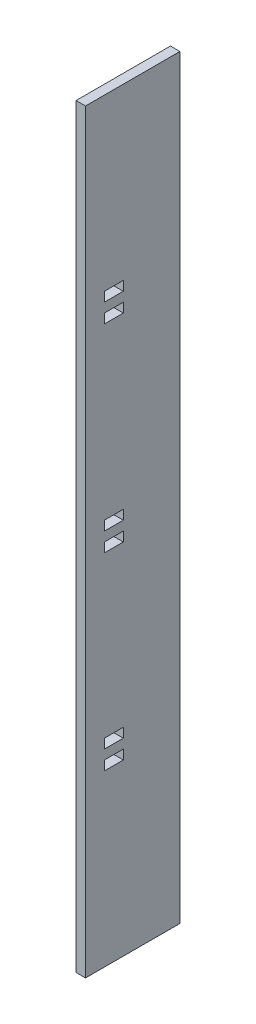
ISO-10303-21;
HEADER;
FILE_DESCRIPTION(('STEP AP214'),'2;1');
FILE_NAME('part.step','',(''),(''),'','','');
FILE_SCHEMA(('AUTOMOTIVE_DESIGN { 1 0 10303 214 1 1 1 1 }'));
ENDSEC;
DATA;
#1=APPLICATION_CONTEXT('core data for automotive mechanical design processes');
#2=APPLICATION_PROTOCOL_DEFINITION('international standard','automotive_design',2000,#1);
#3=PRODUCT_CONTEXT('',#1,'mechanical');
#4=PRODUCT('Part','Part','',(#3));
#5=PRODUCT_RELATED_PRODUCT_CATEGORY('part','',(#4));
#6=PRODUCT_DEFINITION_FORMATION('','',#4);
#7=PRODUCT_DEFINITION_CONTEXT('part definition',#1,'design');
#8=PRODUCT_DEFINITION('design','',#6,#7);
#9=PRODUCT_DEFINITION_SHAPE('','',#8);
#10=(LENGTH_UNIT() NAMED_UNIT(*) SI_UNIT(.MILLI.,.METRE.));
#11=(NAMED_UNIT(*) PLANE_ANGLE_UNIT() SI_UNIT($,.RADIAN.));
#12=(NAMED_UNIT(*) SI_UNIT($,.STERADIAN.) SOLID_ANGLE_UNIT());
#13=UNCERTAINTY_MEASURE_WITH_UNIT(LENGTH_MEASURE(1.E-05),#10,'distance_accuracy_value','');
#14=(GEOMETRIC_REPRESENTATION_CONTEXT(3) GLOBAL_UNCERTAINTY_ASSIGNED_CONTEXT((#13)) GLOBAL_UNIT_ASSIGNED_CONTEXT((#10,
#11,#12)) REPRESENTATION_CONTEXT('',''));
#15=CARTESIAN_POINT('',(0.,0.,0.));
#16=DIRECTION('',(0.,0.,1.));
#17=DIRECTION('',(1.,0.,0.));
#18=AXIS2_PLACEMENT_3D('',#15,#16,#17);
#19=CARTESIAN_POINT('',(6.35,0.,-12.7));
#20=DIRECTION('',(0.,0.,-1.));
#21=DIRECTION('',(-1.,0.,0.));
#22=AXIS2_PLACEMENT_3D('',#19,#20,#21);
#23=PLANE('',#22);
#24=DIRECTION('',(0.,-1.,0.));
#25=VECTOR('',#24,1.);
#26=CARTESIAN_POINT('',(0.,0.,-12.7));
#27=LINE('',#26,#25);
#28=CARTESIAN_POINT('',(0.,381.,-12.7));
#29=VERTEX_POINT('',#28);
#30=CARTESIAN_POINT('',(0.,374.65,-12.7));
#31=VERTEX_POINT('',#30);
#32=EDGE_CURVE('E384',#29,#31,#27,.T.);
#33=ORIENTED_EDGE('',*,*,#32,.F.);
#34=DIRECTION('',(-1.,0.,0.));
#35=VECTOR('',#34,1.);
#36=CARTESIAN_POINT('',(6.35,381.,-12.7));
#37=LINE('',#36,#35);
#38=CARTESIAN_POINT('',(6.35,381.,-12.7));
#39=VERTEX_POINT('',#38);
#40=EDGE_CURVE('E11',#39,#29,#37,.T.);
#41=ORIENTED_EDGE('',*,*,#40,.F.);
#42=DIRECTION('',(0.,-1.,0.));
#43=VECTOR('',#42,1.);
#44=CARTESIAN_POINT('',(6.35,0.,-12.7));
#45=LINE('',#44,#43);
#46=CARTESIAN_POINT('',(6.35,374.65,-12.7));
#47=VERTEX_POINT('',#46);
#48=EDGE_CURVE('E238',#39,#47,#45,.T.);
#49=ORIENTED_EDGE('',*,*,#48,.T.);
#50=DIRECTION('',(-1.,0.,0.));
#51=VECTOR('',#50,1.);
#52=CARTESIAN_POINT('',(6.35,374.65,-12.7));
#53=LINE('',#52,#51);
#54=EDGE_CURVE('E52',#47,#31,#53,.T.);
#55=ORIENTED_EDGE('',*,*,#54,.T.);
#56=EDGE_LOOP('',(#33,#41,#49,#55));
#57=FACE_BOUND('',#56,.T.);
#58=ADVANCED_FACE('F33',(#57),#23,.T.);
#59=CARTESIAN_POINT('',(6.35,381.,0.));
#60=DIRECTION('',(0.,1.,0.));
#61=DIRECTION('',(0.,0.,1.));
#62=AXIS2_PLACEMENT_3D('',#59,#60,#61);
#63=PLANE('',#62);
#64=DIRECTION('',(0.,0.,-1.));
#65=VECTOR('',#64,1.);
#66=CARTESIAN_POINT('',(0.,381.,0.));
#67=LINE('',#66,#65);
#68=CARTESIAN_POINT('',(0.,381.,-25.4));
#69=VERTEX_POINT('',#68);
#70=EDGE_CURVE('E243',#29,#69,#67,.T.);
#71=ORIENTED_EDGE('',*,*,#70,.T.);
#72=DIRECTION('',(-1.,0.,0.));
#73=VECTOR('',#72,1.);
#74=CARTESIAN_POINT('',(6.35,381.,-25.4));
#75=LINE('',#74,#73);
#76=CARTESIAN_POINT('',(6.35,381.,-25.4));
#77=VERTEX_POINT('',#76);
#78=EDGE_CURVE('E43',#77,#69,#75,.T.);
#79=ORIENTED_EDGE('',*,*,#78,.F.);
#80=DIRECTION('',(0.,0.,-1.));
#81=VECTOR('',#80,1.);
#82=CARTESIAN_POINT('',(6.35,381.,0.));
#83=LINE('',#82,#81);
#84=EDGE_CURVE('E233',#39,#77,#83,.T.);
#85=ORIENTED_EDGE('',*,*,#84,.F.);
#86=ORIENTED_EDGE('',*,*,#40,.T.);
#87=EDGE_LOOP('',(#71,#79,#85,#86));
#88=FACE_BOUND('',#87,.T.);
#89=ADVANCED_FACE('F241',(#88),#63,.F.);
#90=CARTESIAN_POINT('',(6.35,0.,-25.4));
#91=DIRECTION('',(0.,0.,-1.));
#92=DIRECTION('',(-1.,0.,0.));
#93=AXIS2_PLACEMENT_3D('',#90,#91,#92);
#94=PLANE('',#93);
#95=DIRECTION('',(0.,-1.,0.));
#96=VECTOR('',#95,1.);
#97=CARTESIAN_POINT('',(0.,0.,-25.4));
#98=LINE('',#97,#96);
#99=CARTESIAN_POINT('',(0.,374.65,-25.4));
#100=VERTEX_POINT('',#99);
#101=EDGE_CURVE('E387',#69,#100,#98,.T.);
#102=ORIENTED_EDGE('',*,*,#101,.T.);
#103=DIRECTION('',(-1.,0.,0.));
#104=VECTOR('',#103,1.);
#105=CARTESIAN_POINT('',(6.35,374.65,-25.4));
#106=LINE('',#105,#104);
#107=CARTESIAN_POINT('',(6.35,374.65,-25.4));
#108=VERTEX_POINT('',#107);
#109=EDGE_CURVE('E138',#108,#100,#106,.T.);
#110=ORIENTED_EDGE('',*,*,#109,.F.);
#111=DIRECTION('',(0.,-1.,0.));
#112=VECTOR('',#111,1.);
#113=CARTESIAN_POINT('',(6.35,0.,-25.4));
#114=LINE('',#113,#112);
#115=EDGE_CURVE('E225',#77,#108,#114,.T.);
#116=ORIENTED_EDGE('',*,*,#115,.F.);
#117=ORIENTED_EDGE('',*,*,#78,.T.);
#118=EDGE_LOOP('',(#102,#110,#116,#117));
#119=FACE_BOUND('',#118,.T.);
#120=ADVANCED_FACE('F227',(#119),#94,.F.);
#121=CARTESIAN_POINT('',(6.35,247.65,0.));
#122=DIRECTION('',(0.,1.,0.));
#123=DIRECTION('',(0.,0.,1.));
#124=AXIS2_PLACEMENT_3D('',#121,#122,#123);
#125=PLANE('',#124);
#126=DIRECTION('',(0.,0.,-1.));
#127=VECTOR('',#126,1.);
#128=CARTESIAN_POINT('',(0.,247.65,0.));
#129=LINE('',#128,#127);
#130=CARTESIAN_POINT('',(0.,247.65,-12.7));
#131=VERTEX_POINT('',#130);
#132=CARTESIAN_POINT('',(0.,247.65,-25.4));
#133=VERTEX_POINT('',#132);
#134=EDGE_CURVE('E372',#131,#133,#129,.T.);
#135=ORIENTED_EDGE('',*,*,#134,.T.);
#136=DIRECTION('',(-1.,0.,0.));
#137=VECTOR('',#136,1.);
#138=CARTESIAN_POINT('',(6.35,247.65,-25.4));
#139=LINE('',#138,#137);
#140=CARTESIAN_POINT('',(6.35,247.65,-25.4));
#141=VERTEX_POINT('',#140);
#142=EDGE_CURVE('E255',#141,#133,#139,.T.);
#143=ORIENTED_EDGE('',*,*,#142,.F.);
#144=DIRECTION('',(0.,0.,-1.));
#145=VECTOR('',#144,1.);
#146=CARTESIAN_POINT('',(6.35,247.65,0.));
#147=LINE('',#146,#145);
#148=CARTESIAN_POINT('',(6.35,247.65,-12.7));
#149=VERTEX_POINT('',#148);
#150=EDGE_CURVE('E446',#149,#141,#147,.T.);
#151=ORIENTED_EDGE('',*,*,#150,.F.);
#152=DIRECTION('',(-1.,0.,0.));
#153=VECTOR('',#152,1.);
#154=CARTESIAN_POINT('',(6.35,247.65,-12.7));
#155=LINE('',#154,#153);
#156=EDGE_CURVE('E248',#149,#131,#155,.T.);
#157=ORIENTED_EDGE('',*,*,#156,.T.);
#158=EDGE_LOOP('',(#135,#143,#151,#157));
#159=FACE_BOUND('',#158,.T.);
#160=ADVANCED_FACE('F493',(#159),#125,.F.);
#161=CARTESIAN_POINT('',(6.35,0.,-25.4000000000001));
#162=DIRECTION('',(0.,0.,-1.));
#163=DIRECTION('',(0.,1.,0.));
#164=AXIS2_PLACEMENT_3D('',#161,#162,#163);
#165=PLANE('',#164);
#166=DIRECTION('',(0.,-1.,0.));
#167=VECTOR('',#166,1.);
#168=CARTESIAN_POINT('',(0.,0.,-25.4000000000001));
#169=LINE('',#168,#167);
#170=CARTESIAN_POINT('',(0.,241.3,-25.4));
#171=VERTEX_POINT('',#170);
#172=EDGE_CURVE('E375',#133,#171,#169,.T.);
#173=ORIENTED_EDGE('',*,*,#172,.T.);
#174=DIRECTION('',(-1.,0.,0.));
#175=VECTOR('',#174,1.);
#176=CARTESIAN_POINT('',(6.35,241.3,-25.4));
#177=LINE('',#176,#175);
#178=CARTESIAN_POINT('',(6.35,241.3,-25.4));
#179=VERTEX_POINT('',#178);
#180=EDGE_CURVE('E253',#179,#171,#177,.T.);
#181=ORIENTED_EDGE('',*,*,#180,.F.);
#182=DIRECTION('',(0.,-1.,0.));
#183=VECTOR('',#182,1.);
#184=CARTESIAN_POINT('',(6.35,0.,-25.4000000000001));
#185=LINE('',#184,#183);
#186=EDGE_CURVE('E449',#141,#179,#185,.T.);
#187=ORIENTED_EDGE('',*,*,#186,.F.);
#188=ORIENTED_EDGE('',*,*,#142,.T.);
#189=EDGE_LOOP('',(#173,#181,#187,#188));
#190=FACE_BOUND('',#189,.T.);
#191=ADVANCED_FACE('F489',(#190),#165,.F.);
#192=CARTESIAN_POINT('',(6.35,241.3,0.));
#193=DIRECTION('',(0.,1.,0.));
#194=DIRECTION('',(0.,0.,1.));
#195=AXIS2_PLACEMENT_3D('',#192,#193,#194);
#196=PLANE('',#195);
#197=DIRECTION('',(0.,0.,-1.));
#198=VECTOR('',#197,1.);
#199=CARTESIAN_POINT('',(0.,241.3,0.));
#200=LINE('',#199,#198);
#201=CARTESIAN_POINT('',(0.,241.3,-12.7));
#202=VERTEX_POINT('',#201);
#203=EDGE_CURVE('E378',#202,#171,#200,.T.);
#204=ORIENTED_EDGE('',*,*,#203,.F.);
#205=DIRECTION('',(-1.,0.,0.));
#206=VECTOR('',#205,1.);
#207=CARTESIAN_POINT('',(6.35,241.3,-12.7));
#208=LINE('',#207,#206);
#209=CARTESIAN_POINT('',(6.35,241.3,-12.7));
#210=VERTEX_POINT('',#209);
#211=EDGE_CURVE('E250',#210,#202,#208,.T.);
#212=ORIENTED_EDGE('',*,*,#211,.F.);
#213=DIRECTION('',(0.,0.,-1.));
#214=VECTOR('',#213,1.);
#215=CARTESIAN_POINT('',(6.35,241.3,0.));
#216=LINE('',#215,#214);
#217=EDGE_CURVE('E451',#210,#179,#216,.T.);
#218=ORIENTED_EDGE('',*,*,#217,.T.);
#219=ORIENTED_EDGE('',*,*,#180,.T.);
#220=EDGE_LOOP('',(#204,#212,#218,#219));
#221=FACE_BOUND('',#220,.T.);
#222=ADVANCED_FACE('F485',(#221),#196,.T.);
#223=CARTESIAN_POINT('',(6.35,120.65,0.));
#224=DIRECTION('',(0.,1.,0.));
#225=DIRECTION('',(0.,0.,1.));
#226=AXIS2_PLACEMENT_3D('',#223,#224,#225);
#227=PLANE('',#226);
#228=DIRECTION('',(0.,0.,-1.));
#229=VECTOR('',#228,1.);
#230=CARTESIAN_POINT('',(0.,120.65,0.));
#231=LINE('',#230,#229);
#232=CARTESIAN_POINT('',(0.,120.65,-12.7));
#233=VERTEX_POINT('',#232);
#234=CARTESIAN_POINT('',(0.,120.65,-25.4));
#235=VERTEX_POINT('',#234);
#236=EDGE_CURVE('E360',#233,#235,#231,.T.);
#237=ORIENTED_EDGE('',*,*,#236,.T.);
#238=DIRECTION('',(-1.,0.,0.));
#239=VECTOR('',#238,1.);
#240=CARTESIAN_POINT('',(6.35,120.65,-25.4));
#241=LINE('',#240,#239);
#242=CARTESIAN_POINT('',(6.35,120.65,-25.4));
#243=VERTEX_POINT('',#242);
#244=EDGE_CURVE('E251',#243,#235,#241,.T.);
#245=ORIENTED_EDGE('',*,*,#244,.F.);
#246=DIRECTION('',(0.,0.,-1.));
#247=VECTOR('',#246,1.);
#248=CARTESIAN_POINT('',(6.35,120.65,0.));
#249=LINE('',#248,#247);
#250=CARTESIAN_POINT('',(6.35,120.65,-12.7));
#251=VERTEX_POINT('',#250);
#252=EDGE_CURVE('E435',#251,#243,#249,.T.);
#253=ORIENTED_EDGE('',*,*,#252,.F.);
#254=DIRECTION('',(-1.,0.,0.));
#255=VECTOR('',#254,1.);
#256=CARTESIAN_POINT('',(6.35,120.65,-12.7));
#257=LINE('',#256,#255);
#258=EDGE_CURVE('E258',#251,#233,#257,.T.);
#259=ORIENTED_EDGE('',*,*,#258,.T.);
#260=EDGE_LOOP('',(#237,#245,#253,#259));
#261=FACE_BOUND('',#260,.T.);
#262=ADVANCED_FACE('F488',(#261),#227,.F.);
#263=CARTESIAN_POINT('',(6.35,0.,-25.4));
#264=DIRECTION('',(0.,0.,-1.));
#265=DIRECTION('',(-1.,0.,0.));
#266=AXIS2_PLACEMENT_3D('',#263,#264,#265);
#267=PLANE('',#266);
#268=DIRECTION('',(0.,-1.,0.));
#269=VECTOR('',#268,1.);
#270=CARTESIAN_POINT('',(0.,0.,-25.4));
#271=LINE('',#270,#269);
#272=CARTESIAN_POINT('',(0.,114.3,-25.4));
#273=VERTEX_POINT('',#272);
#274=EDGE_CURVE('E363',#235,#273,#271,.T.);
#275=ORIENTED_EDGE('',*,*,#274,.T.);
#276=DIRECTION('',(-1.,0.,0.));
#277=VECTOR('',#276,1.);
#278=CARTESIAN_POINT('',(6.35,114.3,-25.4));
#279=LINE('',#278,#277);
#280=CARTESIAN_POINT('',(6.35,114.3,-25.4));
#281=VERTEX_POINT('',#280);
#282=EDGE_CURVE('E263',#281,#273,#279,.T.);
#283=ORIENTED_EDGE('',*,*,#282,.F.);
#284=DIRECTION('',(0.,-1.,0.));
#285=VECTOR('',#284,1.);
#286=CARTESIAN_POINT('',(6.35,0.,-25.4));
#287=LINE('',#286,#285);
#288=EDGE_CURVE('E438',#243,#281,#287,.T.);
#289=ORIENTED_EDGE('',*,*,#288,.F.);
#290=ORIENTED_EDGE('',*,*,#244,.T.);
#291=EDGE_LOOP('',(#275,#283,#289,#290));
#292=FACE_BOUND('',#291,.T.);
#293=ADVANCED_FACE('F506',(#292),#267,.F.);
#294=CARTESIAN_POINT('',(6.35,114.3,0.));
#295=DIRECTION('',(0.,1.,0.));
#296=DIRECTION('',(0.,0.,1.));
#297=AXIS2_PLACEMENT_3D('',#294,#295,#296);
#298=PLANE('',#297);
#299=DIRECTION('',(0.,0.,-1.));
#300=VECTOR('',#299,1.);
#301=CARTESIAN_POINT('',(0.,114.3,0.));
#302=LINE('',#301,#300);
#303=CARTESIAN_POINT('',(0.,114.3,-12.7));
#304=VERTEX_POINT('',#303);
#305=EDGE_CURVE('E366',#304,#273,#302,.T.);
#306=ORIENTED_EDGE('',*,*,#305,.F.);
#307=DIRECTION('',(-1.,0.,0.));
#308=VECTOR('',#307,1.);
#309=CARTESIAN_POINT('',(6.35,114.3,-12.7));
#310=LINE('',#309,#308);
#311=CARTESIAN_POINT('',(6.35,114.3,-12.7));
#312=VERTEX_POINT('',#311);
#313=EDGE_CURVE('E260',#312,#304,#310,.T.);
#314=ORIENTED_EDGE('',*,*,#313,.F.);
#315=DIRECTION('',(0.,0.,-1.));
#316=VECTOR('',#315,1.);
#317=CARTESIAN_POINT('',(6.35,114.3,0.));
#318=LINE('',#317,#316);
#319=EDGE_CURVE('E440',#312,#281,#318,.T.);
#320=ORIENTED_EDGE('',*,*,#319,.T.);
#321=ORIENTED_EDGE('',*,*,#282,.T.);
#322=EDGE_LOOP('',(#306,#314,#320,#321));
#323=FACE_BOUND('',#322,.T.);
#324=ADVANCED_FACE('F502',(#323),#298,.T.);
#325=CARTESIAN_POINT('',(6.35,260.35,0.));
#326=DIRECTION('',(0.,1.,0.));
#327=DIRECTION('',(0.,0.,1.));
#328=AXIS2_PLACEMENT_3D('',#325,#326,#327);
#329=PLANE('',#328);
#330=DIRECTION('',(0.,0.,-1.));
#331=VECTOR('',#330,1.);
#332=CARTESIAN_POINT('',(0.,260.35,0.));
#333=LINE('',#332,#331);
#334=CARTESIAN_POINT('',(0.,260.35,-12.7));
#335=VERTEX_POINT('',#334);
#336=CARTESIAN_POINT('',(0.,260.35,-25.4));
#337=VERTEX_POINT('',#336);
#338=EDGE_CURVE('E348',#335,#337,#333,.T.);
#339=ORIENTED_EDGE('',*,*,#338,.T.);
#340=DIRECTION('',(-1.,0.,0.));
#341=VECTOR('',#340,1.);
#342=CARTESIAN_POINT('',(6.35,260.35,-25.4));
#343=LINE('',#342,#341);
#344=CARTESIAN_POINT('',(6.35,260.35,-25.4));
#345=VERTEX_POINT('',#344);
#346=EDGE_CURVE('E261',#345,#337,#343,.T.);
#347=ORIENTED_EDGE('',*,*,#346,.F.);
#348=DIRECTION('',(0.,0.,-1.));
#349=VECTOR('',#348,1.);
#350=CARTESIAN_POINT('',(6.35,260.35,0.));
#351=LINE('',#350,#349);
#352=CARTESIAN_POINT('',(6.35,260.35,-12.7));
#353=VERTEX_POINT('',#352);
#354=EDGE_CURVE('E424',#353,#345,#351,.T.);
#355=ORIENTED_EDGE('',*,*,#354,.F.);
#356=DIRECTION('',(-1.,0.,0.));
#357=VECTOR('',#356,1.);
#358=CARTESIAN_POINT('',(6.35,260.35,-12.7));
#359=LINE('',#358,#357);
#360=EDGE_CURVE('E267',#353,#335,#359,.T.);
#361=ORIENTED_EDGE('',*,*,#360,.T.);
#362=EDGE_LOOP('',(#339,#347,#355,#361));
#363=FACE_BOUND('',#362,.T.);
#364=ADVANCED_FACE('F505',(#363),#329,.F.);
#365=CARTESIAN_POINT('',(6.35,0.,-25.4));
#366=DIRECTION('',(0.,0.,-1.));
#367=DIRECTION('',(-1.,0.,0.));
#368=AXIS2_PLACEMENT_3D('',#365,#366,#367);
#369=PLANE('',#368);
#370=DIRECTION('',(0.,-1.,0.));
#371=VECTOR('',#370,1.);
#372=CARTESIAN_POINT('',(0.,0.,-25.4));
#373=LINE('',#372,#371);
#374=CARTESIAN_POINT('',(0.,254.,-25.4));
#375=VERTEX_POINT('',#374);
#376=EDGE_CURVE('E351',#337,#375,#373,.T.);
#377=ORIENTED_EDGE('',*,*,#376,.T.);
#378=DIRECTION('',(-1.,0.,0.));
#379=VECTOR('',#378,1.);
#380=CARTESIAN_POINT('',(6.35,254.,-25.4));
#381=LINE('',#380,#379);
#382=CARTESIAN_POINT('',(6.35,254.,-25.4));
#383=VERTEX_POINT('',#382);
#384=EDGE_CURVE('E272',#383,#375,#381,.T.);
#385=ORIENTED_EDGE('',*,*,#384,.F.);
#386=DIRECTION('',(0.,-1.,0.));
#387=VECTOR('',#386,1.);
#388=CARTESIAN_POINT('',(6.35,0.,-25.4));
#389=LINE('',#388,#387);
#390=EDGE_CURVE('E427',#345,#383,#389,.T.);
#391=ORIENTED_EDGE('',*,*,#390,.F.);
#392=ORIENTED_EDGE('',*,*,#346,.T.);
#393=EDGE_LOOP('',(#377,#385,#391,#392));
#394=FACE_BOUND('',#393,.T.);
#395=ADVANCED_FACE('F522',(#394),#369,.F.);
#396=CARTESIAN_POINT('',(6.35,254.,0.));
#397=DIRECTION('',(0.,1.,0.));
#398=DIRECTION('',(0.,0.,1.));
#399=AXIS2_PLACEMENT_3D('',#396,#397,#398);
#400=PLANE('',#399);
#401=DIRECTION('',(0.,0.,-1.));
#402=VECTOR('',#401,1.);
#403=CARTESIAN_POINT('',(0.,254.,0.));
#404=LINE('',#403,#402);
#405=CARTESIAN_POINT('',(0.,254.,-12.7));
#406=VERTEX_POINT('',#405);
#407=EDGE_CURVE('E354',#406,#375,#404,.T.);
#408=ORIENTED_EDGE('',*,*,#407,.F.);
#409=DIRECTION('',(-1.,0.,0.));
#410=VECTOR('',#409,1.);
#411=CARTESIAN_POINT('',(6.35,254.,-12.7));
#412=LINE('',#411,#410);
#413=CARTESIAN_POINT('',(6.35,254.,-12.7));
#414=VERTEX_POINT('',#413);
#415=EDGE_CURVE('E269',#414,#406,#412,.T.);
#416=ORIENTED_EDGE('',*,*,#415,.F.);
#417=DIRECTION('',(0.,0.,-1.));
#418=VECTOR('',#417,1.);
#419=CARTESIAN_POINT('',(6.35,254.,0.));
#420=LINE('',#419,#418);
#421=EDGE_CURVE('E429',#414,#383,#420,.T.);
#422=ORIENTED_EDGE('',*,*,#421,.T.);
#423=ORIENTED_EDGE('',*,*,#384,.T.);
#424=EDGE_LOOP('',(#408,#416,#422,#423));
#425=FACE_BOUND('',#424,.T.);
#426=ADVANCED_FACE('F518',(#425),#400,.T.);
#427=CARTESIAN_POINT('',(6.35,0.,0.));
#428=DIRECTION('',(0.,1.,0.));
#429=DIRECTION('',(0.,0.,1.));
#430=AXIS2_PLACEMENT_3D('',#427,#428,#429);
#431=PLANE('',#430);
#432=DIRECTION('',(0.,0.,-1.));
#433=VECTOR('',#432,1.);
#434=CARTESIAN_POINT('',(0.,0.,0.));
#435=LINE('',#434,#433);
#436=CARTESIAN_POINT('',(0.,0.,0.));
#437=VERTEX_POINT('',#436);
#438=CARTESIAN_POINT('',(0.,0.,-63.5));
#439=VERTEX_POINT('',#438);
#440=EDGE_CURVE('E336',#437,#439,#435,.T.);
#441=ORIENTED_EDGE('',*,*,#440,.T.);
#442=DIRECTION('',(-1.,0.,0.));
#443=VECTOR('',#442,1.);
#444=CARTESIAN_POINT('',(6.35,0.,-63.5));
#445=LINE('',#444,#443);
#446=CARTESIAN_POINT('',(6.35,0.,-63.5));
#447=VERTEX_POINT('',#446);
#448=EDGE_CURVE('E270',#447,#439,#445,.T.);
#449=ORIENTED_EDGE('',*,*,#448,.F.);
#450=DIRECTION('',(0.,0.,-1.));
#451=VECTOR('',#450,1.);
#452=CARTESIAN_POINT('',(6.35,0.,0.));
#453=LINE('',#452,#451);
#454=CARTESIAN_POINT('',(6.35,0.,0.));
#455=VERTEX_POINT('',#454);
#456=EDGE_CURVE('E413',#455,#447,#453,.T.);
#457=ORIENTED_EDGE('',*,*,#456,.F.);
#458=DIRECTION('',(-1.,0.,0.));
#459=VECTOR('',#458,1.);
#460=CARTESIAN_POINT('',(6.35,0.,0.));
#461=LINE('',#460,#459);
#462=EDGE_CURVE('E276',#455,#437,#461,.T.);
#463=ORIENTED_EDGE('',*,*,#462,.T.);
#464=EDGE_LOOP('',(#441,#449,#457,#463));
#465=FACE_BOUND('',#464,.T.);
#466=ADVANCED_FACE('F521',(#465),#431,.F.);
#467=CARTESIAN_POINT('',(6.35,0.,-63.5));
#468=DIRECTION('',(0.,0.,1.));
#469=DIRECTION('',(1.,0.,0.));
#470=AXIS2_PLACEMENT_3D('',#467,#468,#469);
#471=PLANE('',#470);
#472=DIRECTION('',(0.,1.,0.));
#473=VECTOR('',#472,1.);
#474=CARTESIAN_POINT('',(0.,0.,-63.5));
#475=LINE('',#474,#473);
#476=CARTESIAN_POINT('',(0.,508.,-63.5));
#477=VERTEX_POINT('',#476);
#478=EDGE_CURVE('E339',#439,#477,#475,.T.);
#479=ORIENTED_EDGE('',*,*,#478,.T.);
#480=DIRECTION('',(-1.,0.,0.));
#481=VECTOR('',#480,1.);
#482=CARTESIAN_POINT('',(6.35,508.,-63.5));
#483=LINE('',#482,#481);
#484=CARTESIAN_POINT('',(6.35,508.,-63.5));
#485=VERTEX_POINT('',#484);
#486=EDGE_CURVE('E281',#485,#477,#483,.T.);
#487=ORIENTED_EDGE('',*,*,#486,.F.);
#488=DIRECTION('',(0.,1.,0.));
#489=VECTOR('',#488,1.);
#490=CARTESIAN_POINT('',(6.35,0.,-63.5));
#491=LINE('',#490,#489);
#492=EDGE_CURVE('E416',#447,#485,#491,.T.);
#493=ORIENTED_EDGE('',*,*,#492,.F.);
#494=ORIENTED_EDGE('',*,*,#448,.T.);
#495=EDGE_LOOP('',(#479,#487,#493,#494));
#496=FACE_BOUND('',#495,.T.);
#497=ADVANCED_FACE('F537',(#496),#471,.F.);
#498=CARTESIAN_POINT('',(6.35,508.,0.));
#499=DIRECTION('',(0.,1.,0.));
#500=DIRECTION('',(0.,0.,1.));
#501=AXIS2_PLACEMENT_3D('',#498,#499,#500);
#502=PLANE('',#501);
#503=DIRECTION('',(0.,0.,-1.));
#504=VECTOR('',#503,1.);
#505=CARTESIAN_POINT('',(0.,508.,0.));
#506=LINE('',#505,#504);
#507=CARTESIAN_POINT('',(0.,508.,0.));
#508=VERTEX_POINT('',#507);
#509=EDGE_CURVE('E342',#508,#477,#506,.T.);
#510=ORIENTED_EDGE('',*,*,#509,.F.);
#511=DIRECTION('',(-1.,0.,0.));
#512=VECTOR('',#511,1.);
#513=CARTESIAN_POINT('',(6.35,508.,0.));
#514=LINE('',#513,#512);
#515=CARTESIAN_POINT('',(6.35,508.,0.));
#516=VERTEX_POINT('',#515);
#517=EDGE_CURVE('E278',#516,#508,#514,.T.);
#518=ORIENTED_EDGE('',*,*,#517,.F.);
#519=DIRECTION('',(0.,0.,-1.));
#520=VECTOR('',#519,1.);
#521=CARTESIAN_POINT('',(6.35,508.,0.));
#522=LINE('',#521,#520);
#523=EDGE_CURVE('E418',#516,#485,#522,.T.);
#524=ORIENTED_EDGE('',*,*,#523,.T.);
#525=ORIENTED_EDGE('',*,*,#486,.T.);
#526=EDGE_LOOP('',(#510,#518,#524,#525));
#527=FACE_BOUND('',#526,.T.);
#528=ADVANCED_FACE('F533',(#527),#502,.T.);
#529=CARTESIAN_POINT('',(6.35,0.,-25.4));
#530=DIRECTION('',(0.,0.,1.));
#531=DIRECTION('',(1.,0.,0.));
#532=AXIS2_PLACEMENT_3D('',#529,#530,#531);
#533=PLANE('',#532);
#534=DIRECTION('',(0.,1.,0.));
#535=VECTOR('',#534,1.);
#536=CARTESIAN_POINT('',(0.,0.,-25.4));
#537=LINE('',#536,#535);
#538=CARTESIAN_POINT('',(0.,127.,-25.4));
#539=VERTEX_POINT('',#538);
#540=CARTESIAN_POINT('',(0.,133.35,-25.4));
#541=VERTEX_POINT('',#540);
#542=EDGE_CURVE('E324',#539,#541,#537,.T.);
#543=ORIENTED_EDGE('',*,*,#542,.F.);
#544=DIRECTION('',(-1.,0.,0.));
#545=VECTOR('',#544,1.);
#546=CARTESIAN_POINT('',(6.35,127.,-25.4));
#547=LINE('',#546,#545);
#548=CARTESIAN_POINT('',(6.35,127.,-25.4));
#549=VERTEX_POINT('',#548);
#550=EDGE_CURVE('E279',#549,#539,#547,.T.);
#551=ORIENTED_EDGE('',*,*,#550,.F.);
#552=DIRECTION('',(0.,1.,0.));
#553=VECTOR('',#552,1.);
#554=CARTESIAN_POINT('',(6.35,0.,-25.4));
#555=LINE('',#554,#553);
#556=CARTESIAN_POINT('',(6.35,133.35,-25.4));
#557=VERTEX_POINT('',#556);
#558=EDGE_CURVE('E402',#549,#557,#555,.T.);
#559=ORIENTED_EDGE('',*,*,#558,.T.);
#560=DIRECTION('',(-1.,0.,0.));
#561=VECTOR('',#560,1.);
#562=CARTESIAN_POINT('',(6.35,133.35,-25.4));
#563=LINE('',#562,#561);
#564=EDGE_CURVE('E285',#557,#541,#563,.T.);
#565=ORIENTED_EDGE('',*,*,#564,.T.);
#566=EDGE_LOOP('',(#543,#551,#559,#565));
#567=FACE_BOUND('',#566,.T.);
#568=ADVANCED_FACE('F536',(#567),#533,.T.);
#569=CARTESIAN_POINT('',(6.35,127.,0.));
#570=DIRECTION('',(0.,1.,0.));
#571=DIRECTION('',(0.,0.,1.));
#572=AXIS2_PLACEMENT_3D('',#569,#570,#571);
#573=PLANE('',#572);
#574=DIRECTION('',(0.,0.,-1.));
#575=VECTOR('',#574,1.);
#576=CARTESIAN_POINT('',(0.,127.,0.));
#577=LINE('',#576,#575);
#578=CARTESIAN_POINT('',(0.,127.,-12.7));
#579=VERTEX_POINT('',#578);
#580=EDGE_CURVE('E327',#579,#539,#577,.T.);
#581=ORIENTED_EDGE('',*,*,#580,.F.);
#582=DIRECTION('',(-1.,0.,0.));
#583=VECTOR('',#582,1.);
#584=CARTESIAN_POINT('',(6.35,127.,-12.7));
#585=LINE('',#584,#583);
#586=CARTESIAN_POINT('',(6.35,127.,-12.7));
#587=VERTEX_POINT('',#586);
#588=EDGE_CURVE('E290',#587,#579,#585,.T.);
#589=ORIENTED_EDGE('',*,*,#588,.F.);
#590=DIRECTION('',(0.,0.,-1.));
#591=VECTOR('',#590,1.);
#592=CARTESIAN_POINT('',(6.35,127.,0.));
#593=LINE('',#592,#591);
#594=EDGE_CURVE('E405',#587,#549,#593,.T.);
#595=ORIENTED_EDGE('',*,*,#594,.T.);
#596=ORIENTED_EDGE('',*,*,#550,.T.);
#597=EDGE_LOOP('',(#581,#589,#595,#596));
#598=FACE_BOUND('',#597,.T.);
#599=ADVANCED_FACE('F551',(#598),#573,.T.);
#600=CARTESIAN_POINT('',(6.35,0.,-12.7));
#601=DIRECTION('',(0.,0.,1.));
#602=DIRECTION('',(1.,0.,0.));
#603=AXIS2_PLACEMENT_3D('',#600,#601,#602);
#604=PLANE('',#603);
#605=DIRECTION('',(0.,1.,0.));
#606=VECTOR('',#605,1.);
#607=CARTESIAN_POINT('',(0.,0.,-12.7));
#608=LINE('',#607,#606);
#609=CARTESIAN_POINT('',(0.,133.35,-12.7));
#610=VERTEX_POINT('',#609);
#611=EDGE_CURVE('E330',#579,#610,#608,.T.);
#612=ORIENTED_EDGE('',*,*,#611,.T.);
#613=DIRECTION('',(-1.,0.,0.));
#614=VECTOR('',#613,1.);
#615=CARTESIAN_POINT('',(6.35,133.35,-12.7));
#616=LINE('',#615,#614);
#617=CARTESIAN_POINT('',(6.35,133.35,-12.7));
#618=VERTEX_POINT('',#617);
#619=EDGE_CURVE('E287',#618,#610,#616,.T.);
#620=ORIENTED_EDGE('',*,*,#619,.F.);
#621=DIRECTION('',(0.,1.,0.));
#622=VECTOR('',#621,1.);
#623=CARTESIAN_POINT('',(6.35,0.,-12.7));
#624=LINE('',#623,#622);
#625=EDGE_CURVE('E408',#587,#618,#624,.T.);
#626=ORIENTED_EDGE('',*,*,#625,.F.);
#627=ORIENTED_EDGE('',*,*,#588,.T.);
#628=EDGE_LOOP('',(#612,#620,#626,#627));
#629=FACE_BOUND('',#628,.T.);
#630=ADVANCED_FACE('F548',(#629),#604,.F.);
#631=CARTESIAN_POINT('',(6.35,387.35,0.));
#632=DIRECTION('',(0.,1.,0.));
#633=DIRECTION('',(0.,0.,1.));
#634=AXIS2_PLACEMENT_3D('',#631,#632,#633);
#635=PLANE('',#634);
#636=DIRECTION('',(0.,0.,-1.));
#637=VECTOR('',#636,1.);
#638=CARTESIAN_POINT('',(0.,387.35,0.));
#639=LINE('',#638,#637);
#640=CARTESIAN_POINT('',(0.,387.35,-12.7));
#641=VERTEX_POINT('',#640);
#642=CARTESIAN_POINT('',(0.,387.35,-25.4));
#643=VERTEX_POINT('',#642);
#644=EDGE_CURVE('E314',#641,#643,#639,.T.);
#645=ORIENTED_EDGE('',*,*,#644,.F.);
#646=DIRECTION('',(-1.,0.,0.));
#647=VECTOR('',#646,1.);
#648=CARTESIAN_POINT('',(6.35,387.35,-12.7));
#649=LINE('',#648,#647);
#650=CARTESIAN_POINT('',(6.35,387.35,-12.7));
#651=VERTEX_POINT('',#650);
#652=EDGE_CURVE('E37',#651,#641,#649,.T.);
#653=ORIENTED_EDGE('',*,*,#652,.F.);
#654=DIRECTION('',(0.,0.,-1.));
#655=VECTOR('',#654,1.);
#656=CARTESIAN_POINT('',(6.35,387.35,0.));
#657=LINE('',#656,#655);
#658=CARTESIAN_POINT('',(6.35,387.35,-25.4));
#659=VERTEX_POINT('',#658);
#660=EDGE_CURVE('E391',#651,#659,#657,.T.);
#661=ORIENTED_EDGE('',*,*,#660,.T.);
#662=DIRECTION('',(-1.,0.,0.));
#663=VECTOR('',#662,1.);
#664=CARTESIAN_POINT('',(6.35,387.35,-25.4));
#665=LINE('',#664,#663);
#666=EDGE_CURVE('E293',#659,#643,#665,.T.);
#667=ORIENTED_EDGE('',*,*,#666,.T.);
#668=EDGE_LOOP('',(#645,#653,#661,#667));
#669=FACE_BOUND('',#668,.T.);
#670=ADVANCED_FACE('F35',(#669),#635,.T.);
#671=CARTESIAN_POINT('',(6.35,0.,-12.7));
#672=DIRECTION('',(0.,0.,1.));
#673=DIRECTION('',(1.,0.,0.));
#674=AXIS2_PLACEMENT_3D('',#671,#672,#673);
#675=PLANE('',#674);
#676=DIRECTION('',(0.,1.,0.));
#677=VECTOR('',#676,1.);
#678=CARTESIAN_POINT('',(0.,0.,-12.7));
#679=LINE('',#678,#677);
#680=CARTESIAN_POINT('',(0.,393.7,-12.7));
#681=VERTEX_POINT('',#680);
#682=EDGE_CURVE('E306',#641,#681,#679,.T.);
#683=ORIENTED_EDGE('',*,*,#682,.T.);
#684=DIRECTION('',(-1.,0.,0.));
#685=VECTOR('',#684,1.);
#686=CARTESIAN_POINT('',(6.35,393.7,-12.7));
#687=LINE('',#686,#685);
#688=CARTESIAN_POINT('',(6.35,393.7,-12.7));
#689=VERTEX_POINT('',#688);
#690=EDGE_CURVE('E296',#689,#681,#687,.T.);
#691=ORIENTED_EDGE('',*,*,#690,.F.);
#692=DIRECTION('',(0.,1.,0.));
#693=VECTOR('',#692,1.);
#694=CARTESIAN_POINT('',(6.35,0.,-12.7));
#695=LINE('',#694,#693);
#696=EDGE_CURVE('E307',#651,#689,#695,.T.);
#697=ORIENTED_EDGE('',*,*,#696,.F.);
#698=ORIENTED_EDGE('',*,*,#652,.T.);
#699=EDGE_LOOP('',(#683,#691,#697,#698));
#700=FACE_BOUND('',#699,.T.);
#701=ADVANCED_FACE('F305',(#700),#675,.F.);
#702=CARTESIAN_POINT('',(6.35,393.7,0.));
#703=DIRECTION('',(0.,1.,0.));
#704=DIRECTION('',(0.,0.,1.));
#705=AXIS2_PLACEMENT_3D('',#702,#703,#704);
#706=PLANE('',#705);
#707=DIRECTION('',(0.,0.,-1.));
#708=VECTOR('',#707,1.);
#709=CARTESIAN_POINT('',(0.,393.7,0.));
#710=LINE('',#709,#708);
#711=CARTESIAN_POINT('',(0.,393.7,-25.4));
#712=VERTEX_POINT('',#711);
#713=EDGE_CURVE('E316',#681,#712,#710,.T.);
#714=ORIENTED_EDGE('',*,*,#713,.T.);
#715=DIRECTION('',(-1.,0.,0.));
#716=VECTOR('',#715,1.);
#717=CARTESIAN_POINT('',(6.35,393.7,-25.4));
#718=LINE('',#717,#716);
#719=CARTESIAN_POINT('',(6.35,393.7,-25.4));
#720=VERTEX_POINT('',#719);
#721=EDGE_CURVE('E295',#720,#712,#718,.T.);
#722=ORIENTED_EDGE('',*,*,#721,.F.);
#723=DIRECTION('',(0.,0.,-1.));
#724=VECTOR('',#723,1.);
#725=CARTESIAN_POINT('',(6.35,393.7,0.));
#726=LINE('',#725,#724);
#727=EDGE_CURVE('E395',#689,#720,#726,.T.);
#728=ORIENTED_EDGE('',*,*,#727,.F.);
#729=ORIENTED_EDGE('',*,*,#690,.T.);
#730=EDGE_LOOP('',(#714,#722,#728,#729));
#731=FACE_BOUND('',#730,.T.);
#732=ADVANCED_FACE('F483',(#731),#706,.F.);
#733=CARTESIAN_POINT('',(6.35,0.,-12.7));
#734=DIRECTION('',(0.,0.,-1.));
#735=DIRECTION('',(-1.,0.,0.));
#736=AXIS2_PLACEMENT_3D('',#733,#734,#735);
#737=PLANE('',#736);
#738=DIRECTION('',(0.,-1.,0.));
#739=VECTOR('',#738,1.);
#740=CARTESIAN_POINT('',(0.,0.,-12.7));
#741=LINE('',#740,#739);
#742=EDGE_CURVE('E381',#131,#202,#741,.T.);
#743=ORIENTED_EDGE('',*,*,#742,.F.);
#744=ORIENTED_EDGE('',*,*,#156,.F.);
#745=DIRECTION('',(0.,-1.,0.));
#746=VECTOR('',#745,1.);
#747=CARTESIAN_POINT('',(6.35,0.,-12.7));
#748=LINE('',#747,#746);
#749=EDGE_CURVE('E454',#149,#210,#748,.T.);
#750=ORIENTED_EDGE('',*,*,#749,.T.);
#751=ORIENTED_EDGE('',*,*,#211,.T.);
#752=EDGE_LOOP('',(#743,#744,#750,#751));
#753=FACE_BOUND('',#752,.T.);
#754=ADVANCED_FACE('F479',(#753),#737,.T.);
#755=CARTESIAN_POINT('',(6.35,0.,-12.7));
#756=DIRECTION('',(0.,0.,-1.));
#757=DIRECTION('',(-1.,0.,0.));
#758=AXIS2_PLACEMENT_3D('',#755,#756,#757);
#759=PLANE('',#758);
#760=DIRECTION('',(0.,-1.,0.));
#761=VECTOR('',#760,1.);
#762=CARTESIAN_POINT('',(0.,0.,-12.7));
#763=LINE('',#762,#761);
#764=EDGE_CURVE('E369',#233,#304,#763,.T.);
#765=ORIENTED_EDGE('',*,*,#764,.F.);
#766=ORIENTED_EDGE('',*,*,#258,.F.);
#767=DIRECTION('',(0.,-1.,0.));
#768=VECTOR('',#767,1.);
#769=CARTESIAN_POINT('',(6.35,0.,-12.7));
#770=LINE('',#769,#768);
#771=EDGE_CURVE('E443',#251,#312,#770,.T.);
#772=ORIENTED_EDGE('',*,*,#771,.T.);
#773=ORIENTED_EDGE('',*,*,#313,.T.);
#774=EDGE_LOOP('',(#765,#766,#772,#773));
#775=FACE_BOUND('',#774,.T.);
#776=ADVANCED_FACE('F482',(#775),#759,.T.);
#777=CARTESIAN_POINT('',(6.35,0.,-12.7000000000013));
#778=DIRECTION('',(0.,0.,-1.));
#779=DIRECTION('',(0.,1.,0.));
#780=AXIS2_PLACEMENT_3D('',#777,#778,#779);
#781=PLANE('',#780);
#782=DIRECTION('',(0.,-1.,0.));
#783=VECTOR('',#782,1.);
#784=CARTESIAN_POINT('',(0.,0.,-12.7000000000013));
#785=LINE('',#784,#783);
#786=EDGE_CURVE('E357',#335,#406,#785,.T.);
#787=ORIENTED_EDGE('',*,*,#786,.F.);
#788=ORIENTED_EDGE('',*,*,#360,.F.);
#789=DIRECTION('',(0.,-1.,0.));
#790=VECTOR('',#789,1.);
#791=CARTESIAN_POINT('',(6.35,0.,-12.7000000000013));
#792=LINE('',#791,#790);
#793=EDGE_CURVE('E432',#353,#414,#792,.T.);
#794=ORIENTED_EDGE('',*,*,#793,.T.);
#795=ORIENTED_EDGE('',*,*,#415,.T.);
#796=EDGE_LOOP('',(#787,#788,#794,#795));
#797=FACE_BOUND('',#796,.T.);
#798=ADVANCED_FACE('F500',(#797),#781,.T.);
#799=CARTESIAN_POINT('',(6.35,0.,0.));
#800=DIRECTION('',(0.,0.,1.));
#801=DIRECTION('',(1.,0.,0.));
#802=AXIS2_PLACEMENT_3D('',#799,#800,#801);
#803=PLANE('',#802);
#804=DIRECTION('',(0.,1.,0.));
#805=VECTOR('',#804,1.);
#806=CARTESIAN_POINT('',(0.,0.,0.));
#807=LINE('',#806,#805);
#808=EDGE_CURVE('E345',#437,#508,#807,.T.);
#809=ORIENTED_EDGE('',*,*,#808,.F.);
#810=ORIENTED_EDGE('',*,*,#462,.F.);
#811=DIRECTION('',(0.,1.,0.));
#812=VECTOR('',#811,1.);
#813=CARTESIAN_POINT('',(6.35,0.,0.));
#814=LINE('',#813,#812);
#815=EDGE_CURVE('E421',#455,#516,#814,.T.);
#816=ORIENTED_EDGE('',*,*,#815,.T.);
#817=ORIENTED_EDGE('',*,*,#517,.T.);
#818=EDGE_LOOP('',(#809,#810,#816,#817));
#819=FACE_BOUND('',#818,.T.);
#820=ADVANCED_FACE('F516',(#819),#803,.T.);
#821=CARTESIAN_POINT('',(6.35,133.35,0.));
#822=DIRECTION('',(0.,1.,0.));
#823=DIRECTION('',(0.,0.,1.));
#824=AXIS2_PLACEMENT_3D('',#821,#822,#823);
#825=PLANE('',#824);
#826=DIRECTION('',(0.,0.,-1.));
#827=VECTOR('',#826,1.);
#828=CARTESIAN_POINT('',(0.,133.35,0.));
#829=LINE('',#828,#827);
#830=EDGE_CURVE('E333',#610,#541,#829,.T.);
#831=ORIENTED_EDGE('',*,*,#830,.T.);
#832=ORIENTED_EDGE('',*,*,#564,.F.);
#833=DIRECTION('',(0.,0.,-1.));
#834=VECTOR('',#833,1.);
#835=CARTESIAN_POINT('',(6.35,133.35,0.));
#836=LINE('',#835,#834);
#837=EDGE_CURVE('E411',#618,#557,#836,.T.);
#838=ORIENTED_EDGE('',*,*,#837,.F.);
#839=ORIENTED_EDGE('',*,*,#619,.T.);
#840=EDGE_LOOP('',(#831,#832,#838,#839));
#841=FACE_BOUND('',#840,.T.);
#842=ADVANCED_FACE('F467',(#841),#825,.F.);
#843=CARTESIAN_POINT('',(6.35,0.,-25.4));
#844=DIRECTION('',(0.,0.,1.));
#845=DIRECTION('',(1.,0.,0.));
#846=AXIS2_PLACEMENT_3D('',#843,#844,#845);
#847=PLANE('',#846);
#848=DIRECTION('',(0.,1.,0.));
#849=VECTOR('',#848,1.);
#850=CARTESIAN_POINT('',(0.,0.,-25.4));
#851=LINE('',#850,#849);
#852=EDGE_CURVE('E322',#643,#712,#851,.T.);
#853=ORIENTED_EDGE('',*,*,#852,.F.);
#854=ORIENTED_EDGE('',*,*,#666,.F.);
#855=DIRECTION('',(0.,1.,0.));
#856=VECTOR('',#855,1.);
#857=CARTESIAN_POINT('',(6.35,0.,-25.4));
#858=LINE('',#857,#856);
#859=EDGE_CURVE('E399',#659,#720,#858,.T.);
#860=ORIENTED_EDGE('',*,*,#859,.T.);
#861=ORIENTED_EDGE('',*,*,#721,.T.);
#862=EDGE_LOOP('',(#853,#854,#860,#861));
#863=FACE_BOUND('',#862,.T.);
#864=ADVANCED_FACE('F459',(#863),#847,.T.);
#865=CARTESIAN_POINT('',(6.35,374.65,0.));
#866=DIRECTION('',(0.,1.,0.));
#867=DIRECTION('',(0.,0.,1.));
#868=AXIS2_PLACEMENT_3D('',#865,#866,#867);
#869=PLANE('',#868);
#870=DIRECTION('',(0.,0.,-1.));
#871=VECTOR('',#870,1.);
#872=CARTESIAN_POINT('',(0.,374.65,0.));
#873=LINE('',#872,#871);
#874=EDGE_CURVE('E389',#31,#100,#873,.T.);
#875=ORIENTED_EDGE('',*,*,#874,.F.);
#876=ORIENTED_EDGE('',*,*,#54,.F.);
#877=DIRECTION('',(0.,0.,-1.));
#878=VECTOR('',#877,1.);
#879=CARTESIAN_POINT('',(6.35,374.65,0.));
#880=LINE('',#879,#878);
#881=EDGE_CURVE('E232',#47,#108,#880,.T.);
#882=ORIENTED_EDGE('',*,*,#881,.T.);
#883=ORIENTED_EDGE('',*,*,#109,.T.);
#884=EDGE_LOOP('',(#875,#876,#882,#883));
#885=FACE_BOUND('',#884,.T.);
#886=ADVANCED_FACE('F457',(#885),#869,.T.);
#887=CARTESIAN_POINT('',(6.35,0.,0.));
#888=DIRECTION('',(1.,0.,0.));
#889=DIRECTION('',(0.,0.,-1.));
#890=AXIS2_PLACEMENT_3D('',#887,#888,#889);
#891=PLANE('',#890);
#892=ORIENTED_EDGE('',*,*,#660,.F.);
#893=ORIENTED_EDGE('',*,*,#696,.T.);
#894=ORIENTED_EDGE('',*,*,#727,.T.);
#895=ORIENTED_EDGE('',*,*,#859,.F.);
#896=EDGE_LOOP('',(#892,#893,#894,#895));
#897=FACE_BOUND('',#896,.T.);
#898=ORIENTED_EDGE('',*,*,#558,.F.);
#899=ORIENTED_EDGE('',*,*,#594,.F.);
#900=ORIENTED_EDGE('',*,*,#625,.T.);
#901=ORIENTED_EDGE('',*,*,#837,.T.);
#902=EDGE_LOOP('',(#898,#899,#900,#901));
#903=FACE_BOUND('',#902,.T.);
#904=ORIENTED_EDGE('',*,*,#456,.T.);
#905=ORIENTED_EDGE('',*,*,#492,.T.);
#906=ORIENTED_EDGE('',*,*,#523,.F.);
#907=ORIENTED_EDGE('',*,*,#815,.F.);
#908=EDGE_LOOP('',(#904,#905,#906,#907));
#909=FACE_BOUND('',#908,.T.);
#910=ORIENTED_EDGE('',*,*,#354,.T.);
#911=ORIENTED_EDGE('',*,*,#390,.T.);
#912=ORIENTED_EDGE('',*,*,#421,.F.);
#913=ORIENTED_EDGE('',*,*,#793,.F.);
#914=EDGE_LOOP('',(#910,#911,#912,#913));
#915=FACE_BOUND('',#914,.T.);
#916=ORIENTED_EDGE('',*,*,#252,.T.);
#917=ORIENTED_EDGE('',*,*,#288,.T.);
#918=ORIENTED_EDGE('',*,*,#319,.F.);
#919=ORIENTED_EDGE('',*,*,#771,.F.);
#920=EDGE_LOOP('',(#916,#917,#918,#919));
#921=FACE_BOUND('',#920,.T.);
#922=ORIENTED_EDGE('',*,*,#150,.T.);
#923=ORIENTED_EDGE('',*,*,#186,.T.);
#924=ORIENTED_EDGE('',*,*,#217,.F.);
#925=ORIENTED_EDGE('',*,*,#749,.F.);
#926=EDGE_LOOP('',(#922,#923,#924,#925));
#927=FACE_BOUND('',#926,.T.);
#928=ORIENTED_EDGE('',*,*,#48,.F.);
#929=ORIENTED_EDGE('',*,*,#84,.T.);
#930=ORIENTED_EDGE('',*,*,#115,.T.);
#931=ORIENTED_EDGE('',*,*,#881,.F.);
#932=EDGE_LOOP('',(#928,#929,#930,#931));
#933=FACE_BOUND('',#932,.T.);
#934=ADVANCED_FACE('F237',(#897,#903,#909,#915,#921,#927,#933),#891,.T.);
#935=CARTESIAN_POINT('',(0.,0.,0.));
#936=DIRECTION('',(1.,0.,0.));
#937=DIRECTION('',(0.,0.,-1.));
#938=AXIS2_PLACEMENT_3D('',#935,#936,#937);
#939=PLANE('',#938);
#940=ORIENTED_EDGE('',*,*,#644,.T.);
#941=ORIENTED_EDGE('',*,*,#852,.T.);
#942=ORIENTED_EDGE('',*,*,#713,.F.);
#943=ORIENTED_EDGE('',*,*,#682,.F.);
#944=EDGE_LOOP('',(#940,#941,#942,#943));
#945=FACE_BOUND('',#944,.T.);
#946=ORIENTED_EDGE('',*,*,#542,.T.);
#947=ORIENTED_EDGE('',*,*,#830,.F.);
#948=ORIENTED_EDGE('',*,*,#611,.F.);
#949=ORIENTED_EDGE('',*,*,#580,.T.);
#950=EDGE_LOOP('',(#946,#947,#948,#949));
#951=FACE_BOUND('',#950,.T.);
#952=ORIENTED_EDGE('',*,*,#440,.F.);
#953=ORIENTED_EDGE('',*,*,#808,.T.);
#954=ORIENTED_EDGE('',*,*,#509,.T.);
#955=ORIENTED_EDGE('',*,*,#478,.F.);
#956=EDGE_LOOP('',(#952,#953,#954,#955));
#957=FACE_BOUND('',#956,.T.);
#958=ORIENTED_EDGE('',*,*,#338,.F.);
#959=ORIENTED_EDGE('',*,*,#786,.T.);
#960=ORIENTED_EDGE('',*,*,#407,.T.);
#961=ORIENTED_EDGE('',*,*,#376,.F.);
#962=EDGE_LOOP('',(#958,#959,#960,#961));
#963=FACE_BOUND('',#962,.T.);
#964=ORIENTED_EDGE('',*,*,#236,.F.);
#965=ORIENTED_EDGE('',*,*,#764,.T.);
#966=ORIENTED_EDGE('',*,*,#305,.T.);
#967=ORIENTED_EDGE('',*,*,#274,.F.);
#968=EDGE_LOOP('',(#964,#965,#966,#967));
#969=FACE_BOUND('',#968,.T.);
#970=ORIENTED_EDGE('',*,*,#134,.F.);
#971=ORIENTED_EDGE('',*,*,#742,.T.);
#972=ORIENTED_EDGE('',*,*,#203,.T.);
#973=ORIENTED_EDGE('',*,*,#172,.F.);
#974=EDGE_LOOP('',(#970,#971,#972,#973));
#975=FACE_BOUND('',#974,.T.);
#976=ORIENTED_EDGE('',*,*,#32,.T.);
#977=ORIENTED_EDGE('',*,*,#874,.T.);
#978=ORIENTED_EDGE('',*,*,#101,.F.);
#979=ORIENTED_EDGE('',*,*,#70,.F.);
#980=EDGE_LOOP('',(#976,#977,#978,#979));
#981=FACE_BOUND('',#980,.T.);
#982=ADVANCED_FACE('F311',(#945,#951,#957,#963,#969,#975,#981),#939,.F.);
#983=CLOSED_SHELL('',(#58,#89,#120,#160,#191,#222,#262,#293,#324,#364,#395,#426,#466,#497,#528,
#568,#599,#630,#670,#701,#732,#754,#776,#798,#820,#842,#864,#886,#934,#982));
#984=MANIFOLD_SOLID_BREP('B2',#983);
#985=ADVANCED_BREP_SHAPE_REPRESENTATION('',(#18,#984),#14);
#986=SHAPE_DEFINITION_REPRESENTATION(#9,#985);
ENDSEC;
END-ISO-10303-21;
